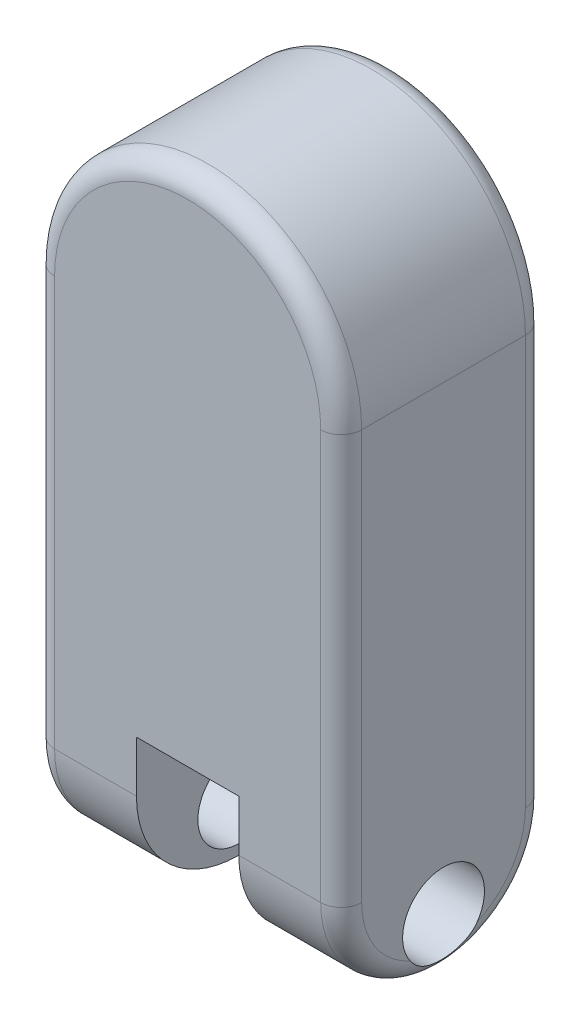
ISO-10303-21;
HEADER;
FILE_DESCRIPTION(('STEP AP214'),'2;1');
FILE_NAME('part.step','',(''),(''),'','','');
FILE_SCHEMA(('AUTOMOTIVE_DESIGN { 1 0 10303 214 1 1 1 1 }'));
ENDSEC;
DATA;
#1=APPLICATION_CONTEXT('core data for automotive mechanical design processes');
#2=APPLICATION_PROTOCOL_DEFINITION('international standard','automotive_design',2000,#1);
#3=PRODUCT_CONTEXT('',#1,'mechanical');
#4=PRODUCT('Part','Part','',(#3));
#5=PRODUCT_RELATED_PRODUCT_CATEGORY('part','',(#4));
#6=PRODUCT_DEFINITION_FORMATION('','',#4);
#7=PRODUCT_DEFINITION_CONTEXT('part definition',#1,'design');
#8=PRODUCT_DEFINITION('design','',#6,#7);
#9=PRODUCT_DEFINITION_SHAPE('','',#8);
#10=(LENGTH_UNIT() NAMED_UNIT(*) SI_UNIT(.MILLI.,.METRE.));
#11=(NAMED_UNIT(*) PLANE_ANGLE_UNIT() SI_UNIT($,.RADIAN.));
#12=(NAMED_UNIT(*) SI_UNIT($,.STERADIAN.) SOLID_ANGLE_UNIT());
#13=UNCERTAINTY_MEASURE_WITH_UNIT(LENGTH_MEASURE(1.E-05),#10,'distance_accuracy_value','');
#14=(GEOMETRIC_REPRESENTATION_CONTEXT(3) GLOBAL_UNCERTAINTY_ASSIGNED_CONTEXT((#13)) GLOBAL_UNIT_ASSIGNED_CONTEXT((#10,
#11,#12)) REPRESENTATION_CONTEXT('',''));
#15=CARTESIAN_POINT('',(0.,0.,0.));
#16=DIRECTION('',(0.,0.,1.));
#17=DIRECTION('',(1.,0.,0.));
#18=AXIS2_PLACEMENT_3D('',#15,#16,#17);
#19=CARTESIAN_POINT('',(-25.,-75.,-100.1));
#20=DIRECTION('',(0.,-1.,0.));
#21=DIRECTION('',(0.,0.,-1.));
#22=AXIS2_PLACEMENT_3D('',#19,#20,#21);
#23=PLANE('',#22);
#24=DIRECTION('',(1.,0.,0.));
#25=VECTOR('',#24,1.);
#26=CARTESIAN_POINT('',(-25.,-75.,-100.));
#27=LINE('',#26,#25);
#28=CARTESIAN_POINT('',(-25.,-75.,-100.));
#29=VERTEX_POINT('',#28);
#30=CARTESIAN_POINT('',(25.,-75.,-100.));
#31=VERTEX_POINT('',#30);
#32=EDGE_CURVE('E92',#29,#31,#27,.T.);
#33=ORIENTED_EDGE('',*,*,#32,.T.);
#34=CARTESIAN_POINT('',(23.5893264020334,-75.,-90.1));
#35=DIRECTION('',(0.,-1.,0.));
#36=DIRECTION('',(0.,0.,-1.));
#37=AXIS2_PLACEMENT_3D('',#34,#35,#36);
#38=CIRCLE('',#37,10.);
#39=CARTESIAN_POINT('',(23.5893264020334,-75.,-100.1));
#40=VERTEX_POINT('',#39);
#41=EDGE_CURVE('E12',#31,#40,#38,.F.);
#42=ORIENTED_EDGE('',*,*,#41,.T.);
#43=DIRECTION('',(1.,0.,0.));
#44=VECTOR('',#43,1.);
#45=CARTESIAN_POINT('',(-25.,-75.,-100.1));
#46=LINE('',#45,#44);
#47=CARTESIAN_POINT('',(-23.5893264020334,-75.,-100.1));
#48=VERTEX_POINT('',#47);
#49=EDGE_CURVE('E116',#48,#40,#46,.T.);
#50=ORIENTED_EDGE('',*,*,#49,.F.);
#51=CARTESIAN_POINT('',(-23.5893264020334,-75.,-90.1));
#52=DIRECTION('',(0.,-1.,0.));
#53=DIRECTION('',(0.,0.,-1.));
#54=AXIS2_PLACEMENT_3D('',#51,#52,#53);
#55=CIRCLE('',#54,10.);
#56=EDGE_CURVE('E55',#48,#29,#55,.F.);
#57=ORIENTED_EDGE('',*,*,#56,.T.);
#58=EDGE_LOOP('',(#33,#42,#50,#57));
#59=FACE_BOUND('',#58,.T.);
#60=ADVANCED_FACE('F46',(#59),#23,.F.);
#61=CARTESIAN_POINT('',(0.,0.,-100.1));
#62=DIRECTION('',(0.,0.,-1.));
#63=DIRECTION('',(-1.,0.,0.));
#64=AXIS2_PLACEMENT_3D('',#61,#62,#63);
#65=PLANE('',#64);
#66=ORIENTED_EDGE('',*,*,#49,.T.);
#67=DIRECTION('',(0.,1.,0.));
#68=VECTOR('',#67,1.);
#69=CARTESIAN_POINT('',(23.5893264020334,-105.,-100.1));
#70=LINE('',#69,#68);
#71=CARTESIAN_POINT('',(23.5893264020334,-103.589326402033,-100.1));
#72=VERTEX_POINT('',#71);
#73=EDGE_CURVE('E104',#40,#72,#70,.F.);
#74=ORIENTED_EDGE('',*,*,#73,.T.);
#75=DIRECTION('',(1.,0.,0.));
#76=VECTOR('',#75,1.);
#77=CARTESIAN_POINT('',(-25.,-103.589326402033,-100.1));
#78=LINE('',#77,#76);
#79=CARTESIAN_POINT('',(-23.5893264020334,-103.589326402033,-100.1));
#80=VERTEX_POINT('',#79);
#81=EDGE_CURVE('E70',#72,#80,#78,.F.);
#82=ORIENTED_EDGE('',*,*,#81,.T.);
#83=DIRECTION('',(0.,-1.,0.));
#84=VECTOR('',#83,1.);
#85=CARTESIAN_POINT('',(-23.5893264020334,-75.,-100.1));
#86=LINE('',#85,#84);
#87=EDGE_CURVE('E107',#80,#48,#86,.F.);
#88=ORIENTED_EDGE('',*,*,#87,.T.);
#89=EDGE_LOOP('',(#66,#74,#82,#88));
#90=FACE_BOUND('',#89,.T.);
#91=ADVANCED_FACE('F120',(#90),#65,.T.);
#92=CARTESIAN_POINT('',(0.,0.,-100.));
#93=DIRECTION('',(0.,0.,-1.));
#94=DIRECTION('',(-1.,0.,0.));
#95=AXIS2_PLACEMENT_3D('',#92,#93,#94);
#96=PLANE('',#95);
#97=ORIENTED_EDGE('',*,*,#32,.F.);
#98=DIRECTION('',(0.,1.,0.));
#99=VECTOR('',#98,1.);
#100=CARTESIAN_POINT('',(-25.,-105.,-100.));
#101=LINE('',#100,#99);
#102=CARTESIAN_POINT('',(-25.,-105.,-100.));
#103=VERTEX_POINT('',#102);
#104=EDGE_CURVE('E115',#103,#29,#101,.T.);
#105=ORIENTED_EDGE('',*,*,#104,.F.);
#106=DIRECTION('',(-1.,0.,0.));
#107=VECTOR('',#106,1.);
#108=CARTESIAN_POINT('',(25.,-105.,-100.));
#109=LINE('',#108,#107);
#110=CARTESIAN_POINT('',(25.,-105.,-100.));
#111=VERTEX_POINT('',#110);
#112=EDGE_CURVE('E95',#111,#103,#109,.T.);
#113=ORIENTED_EDGE('',*,*,#112,.F.);
#114=DIRECTION('',(0.,-1.,0.));
#115=VECTOR('',#114,1.);
#116=CARTESIAN_POINT('',(25.,-75.,-100.));
#117=LINE('',#116,#115);
#118=EDGE_CURVE('E89',#31,#111,#117,.T.);
#119=ORIENTED_EDGE('',*,*,#118,.F.);
#120=EDGE_LOOP('',(#97,#105,#113,#119));
#121=FACE_BOUND('',#120,.T.);
#122=ADVANCED_FACE('F91',(#121),#96,.F.);
#123=CARTESIAN_POINT('',(-23.5893264020334,-105.,-90.1));
#124=DIRECTION('',(0.,1.,0.));
#125=DIRECTION('',(0.,0.,1.));
#126=AXIS2_PLACEMENT_3D('',#123,#124,#125);
#127=CYLINDRICAL_SURFACE('',#126,10.);
#128=ORIENTED_EDGE('',*,*,#56,.F.);
#129=ORIENTED_EDGE('',*,*,#87,.F.);
#130=CARTESIAN_POINT('',(-23.5893264020334,-103.589326402033,-90.1));
#131=DIRECTION('',(-0.707106781186547,0.707106781186547,0.));
#132=DIRECTION('',(0.707106781186547,0.707106781186547,0.));
#133=AXIS2_PLACEMENT_3D('',#130,#131,#132);
#134=ELLIPSE('',#133,14.1421356237309,10.);
#135=EDGE_CURVE('E50',#103,#80,#134,.F.);
#136=ORIENTED_EDGE('',*,*,#135,.F.);
#137=ORIENTED_EDGE('',*,*,#104,.T.);
#138=EDGE_LOOP('',(#128,#129,#136,#137));
#139=FACE_BOUND('',#138,.T.);
#140=ADVANCED_FACE('F48',(#139),#127,.T.);
#141=CARTESIAN_POINT('',(25.,-103.589326402033,-90.1));
#142=DIRECTION('',(-1.,0.,0.));
#143=DIRECTION('',(0.,0.,1.));
#144=AXIS2_PLACEMENT_3D('',#141,#142,#143);
#145=CYLINDRICAL_SURFACE('',#144,10.);
#146=ORIENTED_EDGE('',*,*,#135,.T.);
#147=ORIENTED_EDGE('',*,*,#81,.F.);
#148=CARTESIAN_POINT('',(23.5893264020334,-103.589326402033,-90.1));
#149=DIRECTION('',(-0.707106781186547,-0.707106781186548,0.));
#150=DIRECTION('',(-0.707106781186548,0.707106781186547,0.));
#151=AXIS2_PLACEMENT_3D('',#148,#149,#150);
#152=ELLIPSE('',#151,14.142135623731,10.);
#153=EDGE_CURVE('E63',#111,#72,#152,.F.);
#154=ORIENTED_EDGE('',*,*,#153,.F.);
#155=ORIENTED_EDGE('',*,*,#112,.T.);
#156=EDGE_LOOP('',(#146,#147,#154,#155));
#157=FACE_BOUND('',#156,.T.);
#158=ADVANCED_FACE('F113',(#157),#145,.T.);
#159=CARTESIAN_POINT('',(23.5893264020334,-75.,-90.1));
#160=DIRECTION('',(0.,-1.,0.));
#161=DIRECTION('',(1.,0.,0.));
#162=AXIS2_PLACEMENT_3D('',#159,#160,#161);
#163=CYLINDRICAL_SURFACE('',#162,10.);
#164=ORIENTED_EDGE('',*,*,#41,.F.);
#165=ORIENTED_EDGE('',*,*,#118,.T.);
#166=ORIENTED_EDGE('',*,*,#153,.T.);
#167=ORIENTED_EDGE('',*,*,#73,.F.);
#168=EDGE_LOOP('',(#164,#165,#166,#167));
#169=FACE_BOUND('',#168,.T.);
#170=ADVANCED_FACE('F103',(#169),#163,.T.);
#171=CLOSED_SHELL('',(#60,#91,#122,#140,#158,#170));
#172=MANIFOLD_SOLID_BREP('B2',#171);
#173=CARTESIAN_POINT('',(0.,-75.,-50.));
#174=DIRECTION('',(1.,0.,0.));
#175=DIRECTION('',(0.,0.,-1.));
#176=AXIS2_PLACEMENT_3D('',#173,#174,#175);
#177=CYLINDRICAL_SURFACE('',#176,50.);
#178=DIRECTION('',(1.,0.,0.));
#179=VECTOR('',#178,1.);
#180=CARTESIAN_POINT('',(0.,-75.,0.));
#181=LINE('',#180,#179);
#182=CARTESIAN_POINT('',(-65.,-75.,0.));
#183=VERTEX_POINT('',#182);
#184=CARTESIAN_POINT('',(-25.,-75.,0.));
#185=VERTEX_POINT('',#184);
#186=EDGE_CURVE('E367',#183,#185,#181,.T.);
#187=ORIENTED_EDGE('',*,*,#186,.F.);
#188=CARTESIAN_POINT('',(-65.,-75.,-50.));
#189=DIRECTION('',(-1.,0.,0.));
#190=DIRECTION('',(0.,-1.,0.));
#191=AXIS2_PLACEMENT_3D('',#188,#189,#190);
#192=CIRCLE('',#191,50.);
#193=CARTESIAN_POINT('',(-65.,-125.,-50.));
#194=VERTEX_POINT('',#193);
#195=EDGE_CURVE('E191',#183,#194,#192,.F.);
#196=ORIENTED_EDGE('',*,*,#195,.T.);
#197=DIRECTION('',(1.,0.,0.));
#198=VECTOR('',#197,1.);
#199=CARTESIAN_POINT('',(-75.,-125.,-50.));
#200=LINE('',#199,#198);
#201=CARTESIAN_POINT('',(-25.,-125.,-50.));
#202=VERTEX_POINT('',#201);
#203=EDGE_CURVE('E334',#202,#194,#200,.F.);
#204=ORIENTED_EDGE('',*,*,#203,.F.);
#205=CARTESIAN_POINT('',(-25.,-75.,-50.));
#206=DIRECTION('',(-1.,0.,0.));
#207=DIRECTION('',(0.,0.,1.));
#208=AXIS2_PLACEMENT_3D('',#205,#206,#207);
#209=CIRCLE('',#208,50.);
#210=EDGE_CURVE('E349',#185,#202,#209,.F.);
#211=ORIENTED_EDGE('',*,*,#210,.F.);
#212=EDGE_LOOP('',(#187,#196,#204,#211));
#213=FACE_BOUND('',#212,.T.);
#214=ADVANCED_FACE('F169',(#213),#177,.T.);
#215=CARTESIAN_POINT('',(-75.,-75.,-50.));
#216=DIRECTION('',(-1.,0.,0.));
#217=DIRECTION('',(0.,0.,1.));
#218=AXIS2_PLACEMENT_3D('',#215,#216,#217);
#219=CYLINDRICAL_SURFACE('',#218,50.);
#220=ORIENTED_EDGE('',*,*,#203,.T.);
#221=CARTESIAN_POINT('',(-65.,-75.,-50.));
#222=DIRECTION('',(-1.,0.,0.));
#223=DIRECTION('',(0.,-1.,0.));
#224=AXIS2_PLACEMENT_3D('',#221,#222,#223);
#225=CIRCLE('',#224,50.);
#226=CARTESIAN_POINT('',(-65.,-75.,-100.));
#227=VERTEX_POINT('',#226);
#228=EDGE_CURVE('E177',#194,#227,#225,.F.);
#229=ORIENTED_EDGE('',*,*,#228,.T.);
#230=DIRECTION('',(1.,0.,0.));
#231=VECTOR('',#230,1.);
#232=CARTESIAN_POINT('',(-75.,-75.,-100.));
#233=LINE('',#232,#231);
#234=CARTESIAN_POINT('',(-25.,-75.,-100.));
#235=VERTEX_POINT('',#234);
#236=EDGE_CURVE('E363',#235,#227,#233,.F.);
#237=ORIENTED_EDGE('',*,*,#236,.F.);
#238=CARTESIAN_POINT('',(-25.,-75.,-50.));
#239=DIRECTION('',(-1.,0.,0.));
#240=DIRECTION('',(0.,0.,1.));
#241=AXIS2_PLACEMENT_3D('',#238,#239,#240);
#242=CIRCLE('',#241,50.);
#243=EDGE_CURVE('E355',#202,#235,#242,.F.);
#244=ORIENTED_EDGE('',*,*,#243,.F.);
#245=EDGE_LOOP('',(#220,#229,#237,#244));
#246=FACE_BOUND('',#245,.T.);
#247=ADVANCED_FACE('F466',(#246),#219,.T.);
#248=CARTESIAN_POINT('',(75.,125.,-100.));
#249=DIRECTION('',(1.,0.,0.));
#250=DIRECTION('',(0.,1.,0.));
#251=AXIS2_PLACEMENT_3D('',#248,#249,#250);
#252=PLANE('',#251);
#253=CARTESIAN_POINT('',(75.,-75.,-50.));
#254=DIRECTION('',(1.,0.,0.));
#255=DIRECTION('',(0.,1.,0.));
#256=AXIS2_PLACEMENT_3D('',#253,#254,#255);
#257=CIRCLE('',#256,40.);
#258=CARTESIAN_POINT('',(75.0000000000001,-111.5,-66.3630681719536));
#259=VERTEX_POINT('',#258);
#260=CARTESIAN_POINT('',(75.,-75.,-90.));
#261=VERTEX_POINT('',#260);
#262=EDGE_CURVE('E389',#259,#261,#257,.T.);
#263=ORIENTED_EDGE('',*,*,#262,.T.);
#264=DIRECTION('',(0.,1.,0.));
#265=VECTOR('',#264,1.);
#266=CARTESIAN_POINT('',(75.,125.,-90.));
#267=LINE('',#266,#265);
#268=CARTESIAN_POINT('',(75.,125.,-90.));
#269=VERTEX_POINT('',#268);
#270=EDGE_CURVE('E391',#261,#269,#267,.T.);
#271=ORIENTED_EDGE('',*,*,#270,.T.);
#272=DIRECTION('',(0.,0.,1.));
#273=VECTOR('',#272,1.);
#274=CARTESIAN_POINT('',(75.,125.,-100.));
#275=LINE('',#274,#273);
#276=CARTESIAN_POINT('',(75.,125.,-9.99999999999999));
#277=VERTEX_POINT('',#276);
#278=EDGE_CURVE('E345',#269,#277,#275,.T.);
#279=ORIENTED_EDGE('',*,*,#278,.T.);
#280=DIRECTION('',(0.,1.,0.));
#281=VECTOR('',#280,1.);
#282=CARTESIAN_POINT('',(75.,125.,-9.99999999999999));
#283=LINE('',#282,#281);
#284=CARTESIAN_POINT('',(75.,-75.,-10.));
#285=VERTEX_POINT('',#284);
#286=EDGE_CURVE('E385',#277,#285,#283,.F.);
#287=ORIENTED_EDGE('',*,*,#286,.T.);
#288=CARTESIAN_POINT('',(75.,-75.,-50.));
#289=DIRECTION('',(1.,0.,0.));
#290=DIRECTION('',(0.,1.,0.));
#291=AXIS2_PLACEMENT_3D('',#288,#289,#290);
#292=CIRCLE('',#291,40.);
#293=CARTESIAN_POINT('',(75.,-111.5,-33.6369318280464));
#294=VERTEX_POINT('',#293);
#295=EDGE_CURVE('E387',#285,#294,#292,.T.);
#296=ORIENTED_EDGE('',*,*,#295,.T.);
#297=CARTESIAN_POINT('',(75.,-100.,-50.));
#298=DIRECTION('',(-1.,0.,0.));
#299=DIRECTION('',(0.,-1.,0.));
#300=AXIS2_PLACEMENT_3D('',#297,#298,#299);
#301=CIRCLE('',#300,20.);
#302=EDGE_CURVE('E335',#294,#259,#301,.T.);
#303=ORIENTED_EDGE('',*,*,#302,.T.);
#304=EDGE_LOOP('',(#263,#271,#279,#287,#296,#303));
#305=FACE_BOUND('',#304,.T.);
#306=ADVANCED_FACE('F471',(#305),#252,.T.);
#307=CARTESIAN_POINT('',(-75.,125.,-100.));
#308=DIRECTION('',(-1.,0.,0.));
#309=DIRECTION('',(0.,-1.,0.));
#310=AXIS2_PLACEMENT_3D('',#307,#308,#309);
#311=PLANE('',#310);
#312=CARTESIAN_POINT('',(-75.,-75.,-50.));
#313=DIRECTION('',(-1.,0.,0.));
#314=DIRECTION('',(0.,-1.,0.));
#315=AXIS2_PLACEMENT_3D('',#312,#313,#314);
#316=CIRCLE('',#315,40.);
#317=CARTESIAN_POINT('',(-75.,-111.5,-33.6369318280464));
#318=VERTEX_POINT('',#317);
#319=CARTESIAN_POINT('',(-75.,-75.,-10.));
#320=VERTEX_POINT('',#319);
#321=EDGE_CURVE('E539',#318,#320,#316,.T.);
#322=ORIENTED_EDGE('',*,*,#321,.T.);
#323=DIRECTION('',(0.,-1.,0.));
#324=VECTOR('',#323,1.);
#325=CARTESIAN_POINT('',(-75.,125.,-9.99999999999999));
#326=LINE('',#325,#324);
#327=CARTESIAN_POINT('',(-75.,125.,-9.99999999999999));
#328=VERTEX_POINT('',#327);
#329=EDGE_CURVE('E437',#320,#328,#326,.F.);
#330=ORIENTED_EDGE('',*,*,#329,.T.);
#331=DIRECTION('',(0.,0.,1.));
#332=VECTOR('',#331,1.);
#333=CARTESIAN_POINT('',(-75.,125.,-100.));
#334=LINE('',#333,#332);
#335=CARTESIAN_POINT('',(-75.,125.,-90.));
#336=VERTEX_POINT('',#335);
#337=EDGE_CURVE('E346',#336,#328,#334,.T.);
#338=ORIENTED_EDGE('',*,*,#337,.F.);
#339=DIRECTION('',(0.,-1.,0.));
#340=VECTOR('',#339,1.);
#341=CARTESIAN_POINT('',(-75.,-75.,-90.));
#342=LINE('',#341,#340);
#343=CARTESIAN_POINT('',(-75.,-75.,-90.));
#344=VERTEX_POINT('',#343);
#345=EDGE_CURVE('E533',#336,#344,#342,.T.);
#346=ORIENTED_EDGE('',*,*,#345,.T.);
#347=CARTESIAN_POINT('',(-75.,-75.,-50.));
#348=DIRECTION('',(-1.,0.,0.));
#349=DIRECTION('',(0.,-1.,0.));
#350=AXIS2_PLACEMENT_3D('',#347,#348,#349);
#351=CIRCLE('',#350,40.);
#352=CARTESIAN_POINT('',(-75.,-111.5,-66.3630681719536));
#353=VERTEX_POINT('',#352);
#354=EDGE_CURVE('E538',#344,#353,#351,.T.);
#355=ORIENTED_EDGE('',*,*,#354,.T.);
#356=CARTESIAN_POINT('',(-75.,-100.,-50.));
#357=DIRECTION('',(-1.,0.,0.));
#358=DIRECTION('',(0.,-1.,0.));
#359=AXIS2_PLACEMENT_3D('',#356,#357,#358);
#360=CIRCLE('',#359,20.);
#361=EDGE_CURVE('E339',#318,#353,#360,.T.);
#362=ORIENTED_EDGE('',*,*,#361,.F.);
#363=EDGE_LOOP('',(#322,#330,#338,#346,#355,#362));
#364=FACE_BOUND('',#363,.T.);
#365=ADVANCED_FACE('F544',(#364),#311,.T.);
#366=CARTESIAN_POINT('',(0.,0.,-100.));
#367=DIRECTION('',(0.,0.,1.));
#368=DIRECTION('',(1.,0.,0.));
#369=AXIS2_PLACEMENT_3D('',#366,#367,#368);
#370=PLANE('',#369);
#371=CARTESIAN_POINT('',(0.,125.,-100.));
#372=DIRECTION('',(0.,0.,1.));
#373=DIRECTION('',(1.,0.,0.));
#374=AXIS2_PLACEMENT_3D('',#371,#372,#373);
#375=CIRCLE('',#374,65.);
#376=CARTESIAN_POINT('',(-65.,125.,-100.));
#377=VERTEX_POINT('',#376);
#378=CARTESIAN_POINT('',(65.,125.,-100.));
#379=VERTEX_POINT('',#378);
#380=EDGE_CURVE('E380',#377,#379,#375,.F.);
#381=ORIENTED_EDGE('',*,*,#380,.T.);
#382=DIRECTION('',(0.,1.,0.));
#383=VECTOR('',#382,1.);
#384=CARTESIAN_POINT('',(65.,-75.,-100.));
#385=LINE('',#384,#383);
#386=CARTESIAN_POINT('',(65.,-75.,-100.));
#387=VERTEX_POINT('',#386);
#388=EDGE_CURVE('E383',#379,#387,#385,.F.);
#389=ORIENTED_EDGE('',*,*,#388,.T.);
#390=CARTESIAN_POINT('',(25.,-75.,-100.));
#391=VERTEX_POINT('',#390);
#392=EDGE_CURVE('E368',#387,#391,#233,.F.);
#393=ORIENTED_EDGE('',*,*,#392,.T.);
#394=DIRECTION('',(-1.,0.,0.));
#395=VECTOR('',#394,1.);
#396=CARTESIAN_POINT('',(-25.,-75.,-100.));
#397=LINE('',#396,#395);
#398=EDGE_CURVE('E328',#391,#235,#397,.T.);
#399=ORIENTED_EDGE('',*,*,#398,.T.);
#400=ORIENTED_EDGE('',*,*,#236,.T.);
#401=DIRECTION('',(0.,-1.,0.));
#402=VECTOR('',#401,1.);
#403=CARTESIAN_POINT('',(-65.,125.,-100.));
#404=LINE('',#403,#402);
#405=EDGE_CURVE('E378',#227,#377,#404,.F.);
#406=ORIENTED_EDGE('',*,*,#405,.T.);
#407=EDGE_LOOP('',(#381,#389,#393,#399,#400,#406));
#408=FACE_BOUND('',#407,.T.);
#409=ADVANCED_FACE('F583',(#408),#370,.F.);
#410=CARTESIAN_POINT('',(0.,0.,0.));
#411=DIRECTION('',(0.,0.,1.));
#412=DIRECTION('',(1.,0.,0.));
#413=AXIS2_PLACEMENT_3D('',#410,#411,#412);
#414=PLANE('',#413);
#415=DIRECTION('',(0.,-1.,0.));
#416=VECTOR('',#415,1.);
#417=CARTESIAN_POINT('',(-25.,-75.,0.));
#418=LINE('',#417,#416);
#419=CARTESIAN_POINT('',(-25.,-50.,0.));
#420=VERTEX_POINT('',#419);
#421=EDGE_CURVE('E313',#420,#185,#418,.T.);
#422=ORIENTED_EDGE('',*,*,#421,.F.);
#423=DIRECTION('',(-1.,0.,0.));
#424=VECTOR('',#423,1.);
#425=CARTESIAN_POINT('',(-25.,-50.,0.));
#426=LINE('',#425,#424);
#427=CARTESIAN_POINT('',(25.,-50.,0.));
#428=VERTEX_POINT('',#427);
#429=EDGE_CURVE('E320',#428,#420,#426,.T.);
#430=ORIENTED_EDGE('',*,*,#429,.F.);
#431=DIRECTION('',(0.,1.,0.));
#432=VECTOR('',#431,1.);
#433=CARTESIAN_POINT('',(25.,-50.,0.));
#434=LINE('',#433,#432);
#435=CARTESIAN_POINT('',(25.,-75.,0.));
#436=VERTEX_POINT('',#435);
#437=EDGE_CURVE('E304',#436,#428,#434,.T.);
#438=ORIENTED_EDGE('',*,*,#437,.F.);
#439=CARTESIAN_POINT('',(65.,-75.,0.));
#440=VERTEX_POINT('',#439);
#441=EDGE_CURVE('E370',#436,#440,#181,.T.);
#442=ORIENTED_EDGE('',*,*,#441,.T.);
#443=DIRECTION('',(0.,1.,0.));
#444=VECTOR('',#443,1.);
#445=CARTESIAN_POINT('',(65.,0.,0.));
#446=LINE('',#445,#444);
#447=CARTESIAN_POINT('',(65.,125.,0.));
#448=VERTEX_POINT('',#447);
#449=EDGE_CURVE('E524',#440,#448,#446,.T.);
#450=ORIENTED_EDGE('',*,*,#449,.T.);
#451=CARTESIAN_POINT('',(0.,125.,0.));
#452=DIRECTION('',(0.,0.,1.));
#453=DIRECTION('',(1.,0.,0.));
#454=AXIS2_PLACEMENT_3D('',#451,#452,#453);
#455=CIRCLE('',#454,65.);
#456=CARTESIAN_POINT('',(-65.,125.,0.));
#457=VERTEX_POINT('',#456);
#458=EDGE_CURVE('E529',#448,#457,#455,.T.);
#459=ORIENTED_EDGE('',*,*,#458,.T.);
#460=DIRECTION('',(0.,-1.,0.));
#461=VECTOR('',#460,1.);
#462=CARTESIAN_POINT('',(-65.,0.,0.));
#463=LINE('',#462,#461);
#464=EDGE_CURVE('E498',#457,#183,#463,.T.);
#465=ORIENTED_EDGE('',*,*,#464,.T.);
#466=ORIENTED_EDGE('',*,*,#186,.T.);
#467=EDGE_LOOP('',(#422,#430,#438,#442,#450,#459,#465,#466));
#468=FACE_BOUND('',#467,.T.);
#469=ADVANCED_FACE('F593',(#468),#414,.T.);
#470=CARTESIAN_POINT('',(25.,-150.,-100.));
#471=DIRECTION('',(1.,0.,0.));
#472=DIRECTION('',(0.,0.,-1.));
#473=AXIS2_PLACEMENT_3D('',#470,#471,#472);
#474=PLANE('',#473);
#475=CARTESIAN_POINT('',(25.,-75.,-50.));
#476=DIRECTION('',(1.,0.,0.));
#477=DIRECTION('',(0.,0.,-1.));
#478=AXIS2_PLACEMENT_3D('',#475,#476,#477);
#479=CIRCLE('',#478,50.);
#480=CARTESIAN_POINT('',(25.,-125.,-50.));
#481=VERTEX_POINT('',#480);
#482=EDGE_CURVE('E358',#481,#436,#479,.F.);
#483=ORIENTED_EDGE('',*,*,#482,.T.);
#484=ORIENTED_EDGE('',*,*,#437,.T.);
#485=DIRECTION('',(0.,0.,1.));
#486=VECTOR('',#485,1.);
#487=CARTESIAN_POINT('',(25.,-50.,-99.));
#488=LINE('',#487,#486);
#489=CARTESIAN_POINT('',(25.,-50.,-99.));
#490=VERTEX_POINT('',#489);
#491=EDGE_CURVE('E296',#490,#428,#488,.T.);
#492=ORIENTED_EDGE('',*,*,#491,.F.);
#493=DIRECTION('',(0.,1.,0.));
#494=VECTOR('',#493,1.);
#495=CARTESIAN_POINT('',(25.,-50.,-99.));
#496=LINE('',#495,#494);
#497=CARTESIAN_POINT('',(25.,-74.4302970896538,-99.));
#498=VERTEX_POINT('',#497);
#499=EDGE_CURVE('E302',#498,#490,#496,.T.);
#500=ORIENTED_EDGE('',*,*,#499,.F.);
#501=CARTESIAN_POINT('',(25.,-161.602540378444,-50.));
#502=DIRECTION('',(1.,0.,0.));
#503=DIRECTION('',(0.,0.,-1.));
#504=AXIS2_PLACEMENT_3D('',#501,#502,#503);
#505=CIRCLE('',#504,100.);
#506=EDGE_CURVE('E329',#391,#498,#505,.T.);
#507=ORIENTED_EDGE('',*,*,#506,.F.);
#508=CARTESIAN_POINT('',(25.,-75.,-50.));
#509=DIRECTION('',(1.,0.,0.));
#510=DIRECTION('',(0.,0.,-1.));
#511=AXIS2_PLACEMENT_3D('',#508,#509,#510);
#512=CIRCLE('',#511,50.);
#513=EDGE_CURVE('E360',#391,#481,#512,.F.);
#514=ORIENTED_EDGE('',*,*,#513,.T.);
#515=EDGE_LOOP('',(#483,#484,#492,#500,#507,#514));
#516=FACE_BOUND('',#515,.T.);
#517=CARTESIAN_POINT('',(25.,-100.,-50.));
#518=DIRECTION('',(1.,0.,0.));
#519=DIRECTION('',(0.,0.,-1.));
#520=AXIS2_PLACEMENT_3D('',#517,#518,#519);
#521=CIRCLE('',#520,20.);
#522=CARTESIAN_POINT('',(25.,-100.,-70.));
#523=VERTEX_POINT('',#522);
#524=EDGE_CURVE('E342',#523,#523,#521,.T.);
#525=ORIENTED_EDGE('',*,*,#524,.T.);
#526=EDGE_LOOP('',(#525));
#527=FACE_BOUND('',#526,.T.);
#528=ADVANCED_FACE('F299',(#516,#527),#474,.F.);
#529=CARTESIAN_POINT('',(-25.,-150.,-100.));
#530=DIRECTION('',(-1.,0.,0.));
#531=DIRECTION('',(0.,0.,1.));
#532=AXIS2_PLACEMENT_3D('',#529,#530,#531);
#533=PLANE('',#532);
#534=ORIENTED_EDGE('',*,*,#421,.T.);
#535=ORIENTED_EDGE('',*,*,#210,.T.);
#536=ORIENTED_EDGE('',*,*,#243,.T.);
#537=CARTESIAN_POINT('',(-25.,-161.602540378444,-50.));
#538=DIRECTION('',(1.,0.,0.));
#539=DIRECTION('',(0.,0.,-1.));
#540=AXIS2_PLACEMENT_3D('',#537,#538,#539);
#541=CIRCLE('',#540,100.);
#542=CARTESIAN_POINT('',(-25.,-74.4302970896538,-99.));
#543=VERTEX_POINT('',#542);
#544=EDGE_CURVE('E325',#235,#543,#541,.T.);
#545=ORIENTED_EDGE('',*,*,#544,.T.);
#546=DIRECTION('',(0.,-1.,0.));
#547=VECTOR('',#546,1.);
#548=CARTESIAN_POINT('',(-25.,-75.,-99.));
#549=LINE('',#548,#547);
#550=CARTESIAN_POINT('',(-25.,-50.,-99.));
#551=VERTEX_POINT('',#550);
#552=EDGE_CURVE('E184',#551,#543,#549,.T.);
#553=ORIENTED_EDGE('',*,*,#552,.F.);
#554=DIRECTION('',(0.,0.,1.));
#555=VECTOR('',#554,1.);
#556=CARTESIAN_POINT('',(-25.,-50.,-99.));
#557=LINE('',#556,#555);
#558=EDGE_CURVE('E309',#551,#420,#557,.T.);
#559=ORIENTED_EDGE('',*,*,#558,.T.);
#560=EDGE_LOOP('',(#534,#535,#536,#545,#553,#559));
#561=FACE_BOUND('',#560,.T.);
#562=CARTESIAN_POINT('',(-25.,-100.,-50.));
#563=DIRECTION('',(-1.,0.,0.));
#564=DIRECTION('',(0.,0.,1.));
#565=AXIS2_PLACEMENT_3D('',#562,#563,#564);
#566=CIRCLE('',#565,20.);
#567=CARTESIAN_POINT('',(-25.,-100.,-30.));
#568=VERTEX_POINT('',#567);
#569=EDGE_CURVE('E338',#568,#568,#566,.T.);
#570=ORIENTED_EDGE('',*,*,#569,.T.);
#571=EDGE_LOOP('',(#570));
#572=FACE_BOUND('',#571,.T.);
#573=ADVANCED_FACE('F422',(#561,#572),#533,.F.);
#574=CARTESIAN_POINT('',(75.,-100.,-50.));
#575=DIRECTION('',(-1.,0.,0.));
#576=DIRECTION('',(0.,-1.,0.));
#577=AXIS2_PLACEMENT_3D('',#574,#575,#576);
#578=CYLINDRICAL_SURFACE('',#577,20.);
#579=CARTESIAN_POINT('',(-75.,-111.5,-66.3630681719536));
#580=CARTESIAN_POINT('',(-74.9999944988369,-111.717635786294,-66.2101150233158));
#581=CARTESIAN_POINT('',(-74.9972251505422,-111.932182024762,-66.0528421805292));
#582=CARTESIAN_POINT('',(-74.9867556613727,-112.35473388776,-65.7299474304971));
#583=CARTESIAN_POINT('',(-74.9790561221654,-112.562740307143,-65.5643265442968));
#584=CARTESIAN_POINT('',(-74.9494718778201,-113.176161814739,-65.0555886797702));
#585=CARTESIAN_POINT('',(-74.9210996400918,-113.571325329765,-64.7003530754296));
#586=CARTESIAN_POINT('',(-74.8515096756831,-114.330811895632,-63.9609577577296));
#587=CARTESIAN_POINT('',(-74.8103152955771,-114.695189480587,-63.576851568469));
#588=CARTESIAN_POINT('',(-74.7190573029856,-115.391950208584,-62.7815251896324));
#589=CARTESIAN_POINT('',(-74.6689923089183,-115.724328355308,-62.3703007827167));
#590=CARTESIAN_POINT('',(-74.5631593930954,-116.358618976357,-61.5187034560061));
#591=CARTESIAN_POINT('',(-74.5073357106278,-116.660163582177,-61.0780636594513));
#592=CARTESIAN_POINT('',(-74.3940622995594,-117.226993438192,-60.1742441935076));
#593=CARTESIAN_POINT('',(-74.3366125479803,-117.492278175682,-59.7110642055319));
#594=CARTESIAN_POINT('',(-74.2235017558159,-117.985054029716,-58.7648363026767));
#595=CARTESIAN_POINT('',(-74.167840615512,-118.212547256171,-58.2817894988468));
#596=CARTESIAN_POINT('',(-74.0614849028067,-118.628363325728,-57.2985605452277));
#597=CARTESIAN_POINT('',(-74.0107905215469,-118.816684661646,-56.7983777369727));
#598=CARTESIAN_POINT('',(-73.914628020795,-119.162335252227,-55.7553050669512));
#599=CARTESIAN_POINT('',(-73.8696146444547,-119.31732359583,-55.2115959974652));
#600=CARTESIAN_POINT('',(-73.7912772213222,-119.580856141992,-54.1121164115953));
#601=CARTESIAN_POINT('',(-73.7579530630838,-119.689400787352,-53.5563460102591));
#602=CARTESIAN_POINT('',(-73.7183397843355,-119.816752364834,-52.7160701639446));
#603=CARTESIAN_POINT('',(-73.7068534918599,-119.853323941299,-52.434388327726));
#604=CARTESIAN_POINT('',(-73.6875556329067,-119.914450380322,-51.869577925022));
#605=CARTESIAN_POINT('',(-73.6797440577708,-119.939005271195,-51.586449361947));
#606=CARTESIAN_POINT('',(-73.6679366207012,-119.976034163262,-51.0192418997108));
#607=CARTESIAN_POINT('',(-73.6639419207102,-119.988504485659,-50.7351627375597));
#608=CARTESIAN_POINT('',(-73.6598264732936,-120.001327339773,-50.1666967726029));
#609=CARTESIAN_POINT('',(-73.6597058137055,-120.001679596733,-49.882309962968));
#610=CARTESIAN_POINT('',(-73.6615493262836,-119.995960582491,-49.5980542531014));
#611=B_SPLINE_CURVE_WITH_KNOTS('',3,(#579,#580,#581,#582,#583,#584,#585,#586,#587,#588,#589,
#590,#591,#592,#593,#594,#595,#596,#597,#598,#599,#600,#601,#602,#603,#604,#605,#606,#607,#608,
#609,#610),.UNSPECIFIED.,.F.,.F.,(4,2,2,2,2,2,2,2,2,2,2,2,2,2,2,4),(0.,0.797874642750546,
1.59565193352407,3.18994126089919,4.78134451960051,6.37299585463968,7.98184001143661,
9.59070691451071,11.1994839638915,12.8083229014095,14.5077128583875,16.2070866127463,
17.0596892460926,17.91228987052,18.7651499631724,19.6180293930039),.UNSPECIFIED.);
#612=CARTESIAN_POINT('',(-73.6602540378444,-120.,-50.));
#613=VERTEX_POINT('',#612);
#614=EDGE_CURVE('E429',#353,#613,#611,.T.);
#615=ORIENTED_EDGE('',*,*,#614,.T.);
#616=CARTESIAN_POINT('',(-73.6602540378444,-120.,-50.));
#617=CARTESIAN_POINT('',(-73.660247528865,-120.000000557423,-49.7291162562174));
#618=CARTESIAN_POINT('',(-73.6620203059655,-119.994495715576,-49.4582663052626));
#619=CARTESIAN_POINT('',(-73.6690632302412,-119.972496289671,-48.9170644816353));
#620=CARTESIAN_POINT('',(-73.6743333002115,-119.956001948214,-48.6467125980998));
#621=CARTESIAN_POINT('',(-73.6952902819851,-119.8900894424,-47.8373209986367));
#622=CARTESIAN_POINT('',(-73.7161240917141,-119.824241746037,-47.2996541799824));
#623=CARTESIAN_POINT('',(-73.7701739357349,-119.649543192614,-46.2334838396406));
#624=CARTESIAN_POINT('',(-73.8033583037589,-119.540802269524,-45.7049604702912));
#625=CARTESIAN_POINT('',(-73.8801161670473,-119.281208901752,-44.6590938773701));
#626=CARTESIAN_POINT('',(-73.9236903013259,-119.130353866779,-44.1417513436021));
#627=CARTESIAN_POINT('',(-74.0189152913429,-118.786789461718,-43.1189296044383));
#628=CARTESIAN_POINT('',(-74.0706068716683,-118.593867036125,-42.6135258599768));
#629=CARTESIAN_POINT('',(-74.1788835403941,-118.16796707267,-41.6204488654864));
#630=CARTESIAN_POINT('',(-74.2354685830894,-117.934989908899,-41.1327754499163));
#631=CARTESIAN_POINT('',(-74.3502215235499,-117.430402873405,-40.1779497284365));
#632=CARTESIAN_POINT('',(-74.4083896442132,-117.158787538414,-39.7108003367798));
#633=CARTESIAN_POINT('',(-74.5227473765823,-116.578517537487,-38.7998012021265));
#634=CARTESIAN_POINT('',(-74.5789368427548,-116.269860154377,-38.3559531718098));
#635=CARTESIAN_POINT('',(-74.6878982994192,-115.602912464245,-37.4753289636808));
#636=CARTESIAN_POINT('',(-74.740412180585,-115.243038677624,-37.0397174887075));
#637=CARTESIAN_POINT('',(-74.8345685865417,-114.487138492257,-36.1999281519389));
#638=CARTESIAN_POINT('',(-74.8762127470129,-114.09111754507,-35.7957455671454));
#639=CARTESIAN_POINT('',(-74.9437724111679,-113.26432007541,-35.0206968408248));
#640=CARTESIAN_POINT('',(-74.969646571122,-112.833455521703,-34.6499204268788));
#641=CARTESIAN_POINT('',(-74.992406932906,-112.164262783443,-34.1219764911395));
#642=CARTESIAN_POINT('',(-74.997317042392,-111.937265917523,-33.9506217314705));
#643=CARTESIAN_POINT('',(-75.001019493978,-111.47611190923,-33.6177002554482));
#644=CARTESIAN_POINT('',(-74.9998109947271,-111.241953786537,-33.4561348882949));
#645=CARTESIAN_POINT('',(-74.9951651075579,-111.004453188326,-33.299640422256));
#646=B_SPLINE_CURVE_WITH_KNOTS('',3,(#616,#617,#618,#619,#620,#621,#622,#623,#624,#625,#626,
#627,#628,#629,#630,#631,#632,#633,#634,#635,#636,#637,#638,#639,#640,#641,#642,#643,#644,#645),
.UNSPECIFIED.,.F.,.F.,(4,2,2,2,2,2,2,2,2,2,2,2,2,2,4),(0.,0.812522437824889,1.62502693931455,
3.24916534614429,4.86916790626039,6.4892701290476,8.11777645816379,9.74626757863837,
11.3749891898565,13.0038303470725,14.704137296452,16.404188235224,18.1086771866605,
18.9617565600298,19.8149532408673),.UNSPECIFIED.);
#647=EDGE_CURVE('E436',#613,#318,#646,.T.);
#648=ORIENTED_EDGE('',*,*,#647,.T.);
#649=ORIENTED_EDGE('',*,*,#361,.T.);
#650=EDGE_LOOP('',(#615,#648,#649));
#651=FACE_BOUND('',#650,.T.);
#652=ORIENTED_EDGE('',*,*,#569,.F.);
#653=EDGE_LOOP('',(#652));
#654=FACE_BOUND('',#653,.T.);
#655=ADVANCED_FACE('F418',(#651,#654),#578,.F.);
#656=CARTESIAN_POINT('',(75.,-111.5,-33.6369318280464));
#657=CARTESIAN_POINT('',(74.9999944988369,-111.717635786294,-33.7898849766843));
#658=CARTESIAN_POINT('',(74.9972251505423,-111.932182024762,-33.9471578194709));
#659=CARTESIAN_POINT('',(74.9867556613727,-112.35473388776,-34.2700525695029));
#660=CARTESIAN_POINT('',(74.9790561221654,-112.562740307143,-34.4356734557032));
#661=CARTESIAN_POINT('',(74.9494718778202,-113.176161814739,-34.9444113202299));
#662=CARTESIAN_POINT('',(74.9210996400918,-113.571325329765,-35.2996469245705));
#663=CARTESIAN_POINT('',(74.8515096756831,-114.330811895632,-36.0390422422705));
#664=CARTESIAN_POINT('',(74.8103152955772,-114.695189480587,-36.4231484315311));
#665=CARTESIAN_POINT('',(74.7190573029856,-115.391950208584,-37.2184748103677));
#666=CARTESIAN_POINT('',(74.6689923089183,-115.724328355308,-37.6296992172834));
#667=CARTESIAN_POINT('',(74.5631593930954,-116.358618976357,-38.481296543994));
#668=CARTESIAN_POINT('',(74.5073357106278,-116.660163582177,-38.9219363405487));
#669=CARTESIAN_POINT('',(74.3940622995594,-117.226993438192,-39.8257558064924));
#670=CARTESIAN_POINT('',(74.3366125479804,-117.492278175682,-40.2889357944682));
#671=CARTESIAN_POINT('',(74.223501755816,-117.985054029716,-41.2351636973234));
#672=CARTESIAN_POINT('',(74.1678406155121,-118.212547256171,-41.7182105011532));
#673=CARTESIAN_POINT('',(74.0614849028068,-118.628363325728,-42.7014394547724));
#674=CARTESIAN_POINT('',(74.0107905215469,-118.816684661646,-43.2016222630274));
#675=CARTESIAN_POINT('',(73.914628020795,-119.162335252227,-44.2446949330489));
#676=CARTESIAN_POINT('',(73.8696146444547,-119.31732359583,-44.7884040025349));
#677=CARTESIAN_POINT('',(73.7912772213223,-119.580856141992,-45.8878835884048));
#678=CARTESIAN_POINT('',(73.7579530630838,-119.689400787352,-46.443653989741));
#679=CARTESIAN_POINT('',(73.7183397843356,-119.816752364834,-47.2839298360555));
#680=CARTESIAN_POINT('',(73.7068534918599,-119.853323941299,-47.5656116722741));
#681=CARTESIAN_POINT('',(73.6875556329068,-119.914450380322,-48.1304220749781));
#682=CARTESIAN_POINT('',(73.6797440577708,-119.939005271195,-48.4135506380531));
#683=CARTESIAN_POINT('',(73.6679366207012,-119.976034163262,-48.9807581002893));
#684=CARTESIAN_POINT('',(73.6639419207102,-119.988504485659,-49.2648372624404));
#685=CARTESIAN_POINT('',(73.6598264732937,-120.001327339773,-49.8333032273972));
#686=CARTESIAN_POINT('',(73.6597058137055,-120.001679596733,-50.117690037032));
#687=CARTESIAN_POINT('',(73.6615493262836,-119.995960582491,-50.4019457468986));
#688=B_SPLINE_CURVE_WITH_KNOTS('',3,(#656,#657,#658,#659,#660,#661,#662,#663,#664,#665,#666,
#667,#668,#669,#670,#671,#672,#673,#674,#675,#676,#677,#678,#679,#680,#681,#682,#683,#684,#685,
#686,#687),.UNSPECIFIED.,.F.,.F.,(4,2,2,2,2,2,2,2,2,2,2,2,2,2,2,4),(0.,0.797874642750549,
1.59565193352407,3.1899412608992,4.78134451960055,6.37299585463971,7.98184001143661,
9.59070691451072,11.1994839638915,12.8083229014095,14.5077128583875,16.2070866127463,
17.0596892460926,17.91228987052,18.7651499631725,19.6180293930039),.UNSPECIFIED.);
#689=CARTESIAN_POINT('',(73.6602540378444,-120.,-50.));
#690=VERTEX_POINT('',#689);
#691=EDGE_CURVE('E393',#294,#690,#688,.T.);
#692=ORIENTED_EDGE('',*,*,#691,.T.);
#693=CARTESIAN_POINT('',(73.6602540378444,-120.,-50.));
#694=CARTESIAN_POINT('',(73.660247528865,-120.000000557423,-50.2708837437826));
#695=CARTESIAN_POINT('',(73.6620203059656,-119.994495715576,-50.5417336947374));
#696=CARTESIAN_POINT('',(73.6690632302413,-119.972496289671,-51.0829355183647));
#697=CARTESIAN_POINT('',(73.6743333002116,-119.956001948214,-51.3532874019002));
#698=CARTESIAN_POINT('',(73.6952902819852,-119.8900894424,-52.1626790013633));
#699=CARTESIAN_POINT('',(73.7161240917141,-119.824241746037,-52.7003458200177));
#700=CARTESIAN_POINT('',(73.7701739357349,-119.649543192614,-53.7665161603594));
#701=CARTESIAN_POINT('',(73.8033583037589,-119.540802269524,-54.2950395297088));
#702=CARTESIAN_POINT('',(73.8801161670473,-119.281208901752,-55.3409061226299));
#703=CARTESIAN_POINT('',(73.9236903013259,-119.130353866779,-55.8582486563979));
#704=CARTESIAN_POINT('',(74.0189152913429,-118.786789461718,-56.8810703955617));
#705=CARTESIAN_POINT('',(74.0706068716683,-118.593867036125,-57.3864741400232));
#706=CARTESIAN_POINT('',(74.1788835403941,-118.16796707267,-58.3795511345136));
#707=CARTESIAN_POINT('',(74.2354685830894,-117.934989908899,-58.8672245500837));
#708=CARTESIAN_POINT('',(74.3502215235499,-117.430402873405,-59.8220502715635));
#709=CARTESIAN_POINT('',(74.4083896442133,-117.158787538414,-60.2891996632202));
#710=CARTESIAN_POINT('',(74.5227473765823,-116.578517537487,-61.2001987978735));
#711=CARTESIAN_POINT('',(74.5789368427548,-116.269860154377,-61.6440468281903));
#712=CARTESIAN_POINT('',(74.6878982994192,-115.602912464245,-62.5246710363192));
#713=CARTESIAN_POINT('',(74.740412180585,-115.243038677624,-62.9602825112926));
#714=CARTESIAN_POINT('',(74.8345685865418,-114.487138492257,-63.8000718480611));
#715=CARTESIAN_POINT('',(74.8762127470129,-114.09111754507,-64.2042544328546));
#716=CARTESIAN_POINT('',(74.943772411168,-113.26432007541,-64.9793031591752));
#717=CARTESIAN_POINT('',(74.969646571122,-112.833455521703,-65.3500795731212));
#718=CARTESIAN_POINT('',(74.992406932906,-112.164262783443,-65.8780235088606));
#719=CARTESIAN_POINT('',(74.997317042392,-111.937265917523,-66.0493782685295));
#720=CARTESIAN_POINT('',(75.001019493978,-111.47611190923,-66.3822997445518));
#721=CARTESIAN_POINT('',(74.9998109947272,-111.241953786537,-66.5438651117052));
#722=CARTESIAN_POINT('',(74.9951651075579,-111.004453188326,-66.700359577744));
#723=B_SPLINE_CURVE_WITH_KNOTS('',3,(#693,#694,#695,#696,#697,#698,#699,#700,#701,#702,#703,
#704,#705,#706,#707,#708,#709,#710,#711,#712,#713,#714,#715,#716,#717,#718,#719,#720,#721,#722),
.UNSPECIFIED.,.F.,.F.,(4,2,2,2,2,2,2,2,2,2,2,2,2,2,4),(0.,0.81252243782489,1.62502693931455,
3.24916534614429,4.86916790626039,6.48927012904759,8.11777645816379,9.74626757863838,
11.3749891898565,13.0038303470725,14.7041372964521,16.404188235224,18.1086771866605,
18.9617565600298,19.8149532408674),.UNSPECIFIED.);
#724=EDGE_CURVE('E401',#690,#259,#723,.T.);
#725=ORIENTED_EDGE('',*,*,#724,.T.);
#726=ORIENTED_EDGE('',*,*,#302,.F.);
#727=EDGE_LOOP('',(#692,#725,#726));
#728=FACE_BOUND('',#727,.T.);
#729=ORIENTED_EDGE('',*,*,#524,.F.);
#730=EDGE_LOOP('',(#729));
#731=FACE_BOUND('',#730,.T.);
#732=ADVANCED_FACE('F412',(#728,#731),#578,.F.);
#733=DIRECTION('',(1.,0.,0.));
#734=VECTOR('',#733,1.);
#735=CARTESIAN_POINT('',(50.,-125.,-50.));
#736=LINE('',#735,#734);
#737=CARTESIAN_POINT('',(65.,-125.,-50.));
#738=VERTEX_POINT('',#737);
#739=EDGE_CURVE('E364',#738,#481,#736,.F.);
#740=ORIENTED_EDGE('',*,*,#739,.F.);
#741=CARTESIAN_POINT('',(65.,-75.,-50.));
#742=DIRECTION('',(1.,0.,0.));
#743=DIRECTION('',(0.,1.,0.));
#744=AXIS2_PLACEMENT_3D('',#741,#742,#743);
#745=CIRCLE('',#744,50.);
#746=EDGE_CURVE('E486',#738,#440,#745,.F.);
#747=ORIENTED_EDGE('',*,*,#746,.T.);
#748=ORIENTED_EDGE('',*,*,#441,.F.);
#749=ORIENTED_EDGE('',*,*,#482,.F.);
#750=EDGE_LOOP('',(#740,#747,#748,#749));
#751=FACE_BOUND('',#750,.T.);
#752=ADVANCED_FACE('F417',(#751),#177,.T.);
#753=ORIENTED_EDGE('',*,*,#392,.F.);
#754=CARTESIAN_POINT('',(65.,-75.,-50.));
#755=DIRECTION('',(1.,0.,0.));
#756=DIRECTION('',(0.,1.,0.));
#757=AXIS2_PLACEMENT_3D('',#754,#755,#756);
#758=CIRCLE('',#757,50.);
#759=EDGE_CURVE('E499',#387,#738,#758,.F.);
#760=ORIENTED_EDGE('',*,*,#759,.T.);
#761=ORIENTED_EDGE('',*,*,#739,.T.);
#762=ORIENTED_EDGE('',*,*,#513,.F.);
#763=EDGE_LOOP('',(#753,#760,#761,#762));
#764=FACE_BOUND('',#763,.T.);
#765=ADVANCED_FACE('F474',(#764),#219,.T.);
#766=CARTESIAN_POINT('',(-25.,-161.602540378444,-50.));
#767=DIRECTION('',(1.,0.,0.));
#768=DIRECTION('',(0.,0.,-1.));
#769=AXIS2_PLACEMENT_3D('',#766,#767,#768);
#770=CYLINDRICAL_SURFACE('',#769,100.);
#771=ORIENTED_EDGE('',*,*,#506,.T.);
#772=DIRECTION('',(1.,0.,0.));
#773=VECTOR('',#772,1.);
#774=CARTESIAN_POINT('',(-25.,-74.4302970896538,-99.));
#775=LINE('',#774,#773);
#776=EDGE_CURVE('E44',#498,#543,#775,.F.);
#777=ORIENTED_EDGE('',*,*,#776,.T.);
#778=ORIENTED_EDGE('',*,*,#544,.F.);
#779=ORIENTED_EDGE('',*,*,#398,.F.);
#780=EDGE_LOOP('',(#771,#777,#778,#779));
#781=FACE_BOUND('',#780,.T.);
#782=ADVANCED_FACE('F420',(#781),#770,.F.);
#783=CARTESIAN_POINT('',(0.,125.,-100.));
#784=DIRECTION('',(0.,0.,1.));
#785=DIRECTION('',(1.,0.,0.));
#786=AXIS2_PLACEMENT_3D('',#783,#784,#785);
#787=CYLINDRICAL_SURFACE('',#786,75.);
#788=ORIENTED_EDGE('',*,*,#278,.F.);
#789=CARTESIAN_POINT('',(0.,125.,-90.));
#790=DIRECTION('',(0.,0.,1.));
#791=DIRECTION('',(1.,0.,0.));
#792=AXIS2_PLACEMENT_3D('',#789,#790,#791);
#793=CIRCLE('',#792,75.);
#794=EDGE_CURVE('E375',#269,#336,#793,.T.);
#795=ORIENTED_EDGE('',*,*,#794,.T.);
#796=ORIENTED_EDGE('',*,*,#337,.T.);
#797=CARTESIAN_POINT('',(0.,125.,-9.99999999999999));
#798=DIRECTION('',(0.,0.,1.));
#799=DIRECTION('',(1.,0.,0.));
#800=AXIS2_PLACEMENT_3D('',#797,#798,#799);
#801=CIRCLE('',#800,75.);
#802=EDGE_CURVE('E366',#328,#277,#801,.F.);
#803=ORIENTED_EDGE('',*,*,#802,.T.);
#804=EDGE_LOOP('',(#788,#795,#796,#803));
#805=FACE_BOUND('',#804,.T.);
#806=ADVANCED_FACE('F549',(#805),#787,.T.);
#807=CARTESIAN_POINT('',(0.,125.,-9.99999999999999));
#808=DIRECTION('',(0.,0.,1.));
#809=DIRECTION('',(1.,0.,0.));
#810=AXIS2_PLACEMENT_3D('',#807,#808,#809);
#811=TOROIDAL_SURFACE('',#810,65.,10.);
#812=CARTESIAN_POINT('',(-65.,125.,-10.));
#813=DIRECTION('',(0.,-1.,0.));
#814=DIRECTION('',(0.,0.,-1.));
#815=AXIS2_PLACEMENT_3D('',#812,#813,#814);
#816=CIRCLE('',#815,10.);
#817=EDGE_CURVE('E516',#457,#328,#816,.T.);
#818=ORIENTED_EDGE('',*,*,#817,.F.);
#819=ORIENTED_EDGE('',*,*,#458,.F.);
#820=CARTESIAN_POINT('',(65.,125.,-9.99999999999999));
#821=DIRECTION('',(0.,-1.,0.));
#822=DIRECTION('',(0.,0.,-1.));
#823=AXIS2_PLACEMENT_3D('',#820,#821,#822);
#824=CIRCLE('',#823,10.);
#825=EDGE_CURVE('E331',#277,#448,#824,.T.);
#826=ORIENTED_EDGE('',*,*,#825,.F.);
#827=ORIENTED_EDGE('',*,*,#802,.F.);
#828=EDGE_LOOP('',(#818,#819,#826,#827));
#829=FACE_BOUND('',#828,.T.);
#830=ADVANCED_FACE('F171',(#829),#811,.T.);
#831=CARTESIAN_POINT('',(65.,0.,-10.));
#832=DIRECTION('',(0.,1.,0.));
#833=DIRECTION('',(-1.,0.,0.));
#834=AXIS2_PLACEMENT_3D('',#831,#832,#833);
#835=CYLINDRICAL_SURFACE('',#834,10.);
#836=ORIENTED_EDGE('',*,*,#825,.T.);
#837=ORIENTED_EDGE('',*,*,#449,.F.);
#838=CARTESIAN_POINT('',(65.,-75.,-10.));
#839=DIRECTION('',(0.,-1.,0.));
#840=DIRECTION('',(0.,0.,-1.));
#841=AXIS2_PLACEMENT_3D('',#838,#839,#840);
#842=CIRCLE('',#841,10.);
#843=EDGE_CURVE('E497',#285,#440,#842,.T.);
#844=ORIENTED_EDGE('',*,*,#843,.F.);
#845=ORIENTED_EDGE('',*,*,#286,.F.);
#846=EDGE_LOOP('',(#836,#837,#844,#845));
#847=FACE_BOUND('',#846,.T.);
#848=ADVANCED_FACE('F523',(#847),#835,.T.);
#849=CARTESIAN_POINT('',(-65.,0.,-10.));
#850=DIRECTION('',(0.,-1.,0.));
#851=DIRECTION('',(1.,0.,0.));
#852=AXIS2_PLACEMENT_3D('',#849,#850,#851);
#853=CYLINDRICAL_SURFACE('',#852,10.);
#854=ORIENTED_EDGE('',*,*,#817,.T.);
#855=ORIENTED_EDGE('',*,*,#329,.F.);
#856=CARTESIAN_POINT('',(-65.,-75.,-10.));
#857=DIRECTION('',(0.,-1.,0.));
#858=DIRECTION('',(0.,0.,-1.));
#859=AXIS2_PLACEMENT_3D('',#856,#857,#858);
#860=CIRCLE('',#859,10.);
#861=EDGE_CURVE('E505',#183,#320,#860,.T.);
#862=ORIENTED_EDGE('',*,*,#861,.F.);
#863=ORIENTED_EDGE('',*,*,#464,.F.);
#864=EDGE_LOOP('',(#854,#855,#862,#863));
#865=FACE_BOUND('',#864,.T.);
#866=ADVANCED_FACE('F462',(#865),#853,.T.);
#867=CARTESIAN_POINT('',(65.,-75.,-50.));
#868=DIRECTION('',(1.,0.,0.));
#869=DIRECTION('',(0.,1.,0.));
#870=AXIS2_PLACEMENT_3D('',#867,#868,#869);
#871=TOROIDAL_SURFACE('',#870,40.,10.);
#872=ORIENTED_EDGE('',*,*,#843,.T.);
#873=ORIENTED_EDGE('',*,*,#746,.F.);
#874=CARTESIAN_POINT('',(65.,-115.,-50.));
#875=DIRECTION('',(0.,0.,-1.));
#876=DIRECTION('',(-1.,0.,0.));
#877=AXIS2_PLACEMENT_3D('',#874,#875,#876);
#878=CIRCLE('',#877,10.);
#879=EDGE_CURVE('E493',#690,#738,#878,.T.);
#880=ORIENTED_EDGE('',*,*,#879,.F.);
#881=ORIENTED_EDGE('',*,*,#691,.F.);
#882=ORIENTED_EDGE('',*,*,#295,.F.);
#883=EDGE_LOOP('',(#872,#873,#880,#881,#882));
#884=FACE_BOUND('',#883,.T.);
#885=ADVANCED_FACE('F408',(#884),#871,.T.);
#886=CARTESIAN_POINT('',(-65.,-75.,-50.));
#887=DIRECTION('',(-1.,0.,0.));
#888=DIRECTION('',(0.,-1.,0.));
#889=AXIS2_PLACEMENT_3D('',#886,#887,#888);
#890=TOROIDAL_SURFACE('',#889,40.,10.);
#891=ORIENTED_EDGE('',*,*,#321,.F.);
#892=ORIENTED_EDGE('',*,*,#647,.F.);
#893=CARTESIAN_POINT('',(-65.,-115.,-50.));
#894=DIRECTION('',(0.,0.,-1.));
#895=DIRECTION('',(-1.,0.,0.));
#896=AXIS2_PLACEMENT_3D('',#893,#894,#895);
#897=CIRCLE('',#896,10.);
#898=EDGE_CURVE('E506',#194,#613,#897,.T.);
#899=ORIENTED_EDGE('',*,*,#898,.F.);
#900=ORIENTED_EDGE('',*,*,#195,.F.);
#901=ORIENTED_EDGE('',*,*,#861,.T.);
#902=EDGE_LOOP('',(#891,#892,#899,#900,#901));
#903=FACE_BOUND('',#902,.T.);
#904=ADVANCED_FACE('F454',(#903),#890,.T.);
#905=CARTESIAN_POINT('',(65.,-75.,-50.));
#906=DIRECTION('',(1.,0.,0.));
#907=DIRECTION('',(0.,1.,0.));
#908=AXIS2_PLACEMENT_3D('',#905,#906,#907);
#909=TOROIDAL_SURFACE('',#908,40.,10.);
#910=ORIENTED_EDGE('',*,*,#879,.T.);
#911=ORIENTED_EDGE('',*,*,#759,.F.);
#912=CARTESIAN_POINT('',(65.,-75.,-90.));
#913=DIRECTION('',(0.,1.,0.));
#914=DIRECTION('',(0.,0.,1.));
#915=AXIS2_PLACEMENT_3D('',#912,#913,#914);
#916=CIRCLE('',#915,10.);
#917=EDGE_CURVE('E511',#261,#387,#916,.T.);
#918=ORIENTED_EDGE('',*,*,#917,.F.);
#919=ORIENTED_EDGE('',*,*,#262,.F.);
#920=ORIENTED_EDGE('',*,*,#724,.F.);
#921=EDGE_LOOP('',(#910,#911,#918,#919,#920));
#922=FACE_BOUND('',#921,.T.);
#923=ADVANCED_FACE('F449',(#922),#909,.T.);
#924=CARTESIAN_POINT('',(-65.,-75.,-50.));
#925=DIRECTION('',(-1.,0.,0.));
#926=DIRECTION('',(0.,-1.,0.));
#927=AXIS2_PLACEMENT_3D('',#924,#925,#926);
#928=TOROIDAL_SURFACE('',#927,40.,10.);
#929=ORIENTED_EDGE('',*,*,#614,.F.);
#930=ORIENTED_EDGE('',*,*,#354,.F.);
#931=CARTESIAN_POINT('',(-65.,-75.,-90.));
#932=DIRECTION('',(0.,1.,0.));
#933=DIRECTION('',(0.,0.,1.));
#934=AXIS2_PLACEMENT_3D('',#931,#932,#933);
#935=CIRCLE('',#934,10.);
#936=EDGE_CURVE('E565',#227,#344,#935,.T.);
#937=ORIENTED_EDGE('',*,*,#936,.F.);
#938=ORIENTED_EDGE('',*,*,#228,.F.);
#939=ORIENTED_EDGE('',*,*,#898,.T.);
#940=EDGE_LOOP('',(#929,#930,#937,#938,#939));
#941=FACE_BOUND('',#940,.T.);
#942=ADVANCED_FACE('F444',(#941),#928,.T.);
#943=CARTESIAN_POINT('',(65.,125.,-90.));
#944=DIRECTION('',(0.,-1.,0.));
#945=DIRECTION('',(1.,0.,0.));
#946=AXIS2_PLACEMENT_3D('',#943,#944,#945);
#947=CYLINDRICAL_SURFACE('',#946,10.);
#948=ORIENTED_EDGE('',*,*,#917,.T.);
#949=ORIENTED_EDGE('',*,*,#388,.F.);
#950=CARTESIAN_POINT('',(65.,125.,-90.));
#951=DIRECTION('',(0.,1.,0.));
#952=DIRECTION('',(0.,0.,1.));
#953=AXIS2_PLACEMENT_3D('',#950,#951,#952);
#954=CIRCLE('',#953,10.);
#955=EDGE_CURVE('E555',#269,#379,#954,.T.);
#956=ORIENTED_EDGE('',*,*,#955,.F.);
#957=ORIENTED_EDGE('',*,*,#270,.F.);
#958=EDGE_LOOP('',(#948,#949,#956,#957));
#959=FACE_BOUND('',#958,.T.);
#960=ADVANCED_FACE('F448',(#959),#947,.T.);
#961=CARTESIAN_POINT('',(-65.,125.,-90.));
#962=DIRECTION('',(0.,1.,0.));
#963=DIRECTION('',(-1.,0.,0.));
#964=AXIS2_PLACEMENT_3D('',#961,#962,#963);
#965=CYLINDRICAL_SURFACE('',#964,10.);
#966=ORIENTED_EDGE('',*,*,#936,.T.);
#967=ORIENTED_EDGE('',*,*,#345,.F.);
#968=CARTESIAN_POINT('',(-65.,125.,-90.));
#969=DIRECTION('',(0.,1.,0.));
#970=DIRECTION('',(0.,0.,1.));
#971=AXIS2_PLACEMENT_3D('',#968,#969,#970);
#972=CIRCLE('',#971,10.);
#973=EDGE_CURVE('E323',#377,#336,#972,.T.);
#974=ORIENTED_EDGE('',*,*,#973,.F.);
#975=ORIENTED_EDGE('',*,*,#405,.F.);
#976=EDGE_LOOP('',(#966,#967,#974,#975));
#977=FACE_BOUND('',#976,.T.);
#978=ADVANCED_FACE('F563',(#977),#965,.T.);
#979=CARTESIAN_POINT('',(0.,125.,-90.));
#980=DIRECTION('',(0.,0.,1.));
#981=DIRECTION('',(1.,0.,0.));
#982=AXIS2_PLACEMENT_3D('',#979,#980,#981);
#983=TOROIDAL_SURFACE('',#982,65.,10.);
#984=ORIENTED_EDGE('',*,*,#955,.T.);
#985=ORIENTED_EDGE('',*,*,#380,.F.);
#986=ORIENTED_EDGE('',*,*,#973,.T.);
#987=ORIENTED_EDGE('',*,*,#794,.F.);
#988=EDGE_LOOP('',(#984,#985,#986,#987));
#989=FACE_BOUND('',#988,.T.);
#990=ADVANCED_FACE('F553',(#989),#983,.T.);
#991=CARTESIAN_POINT('',(-25.,-50.,-99.));
#992=DIRECTION('',(0.,1.,0.));
#993=DIRECTION('',(-1.,0.,0.));
#994=AXIS2_PLACEMENT_3D('',#991,#992,#993);
#995=PLANE('',#994);
#996=ORIENTED_EDGE('',*,*,#491,.T.);
#997=ORIENTED_EDGE('',*,*,#429,.T.);
#998=ORIENTED_EDGE('',*,*,#558,.F.);
#999=DIRECTION('',(-1.,0.,0.));
#1000=VECTOR('',#999,1.);
#1001=CARTESIAN_POINT('',(-25.,-50.,-99.));
#1002=LINE('',#1001,#1000);
#1003=EDGE_CURVE('E312',#490,#551,#1002,.T.);
#1004=ORIENTED_EDGE('',*,*,#1003,.F.);
#1005=EDGE_LOOP('',(#996,#997,#998,#1004));
#1006=FACE_BOUND('',#1005,.T.);
#1007=ADVANCED_FACE('F315',(#1006),#995,.F.);
#1008=CARTESIAN_POINT('',(0.,0.,-99.));
#1009=DIRECTION('',(0.,0.,-1.));
#1010=DIRECTION('',(-1.,0.,0.));
#1011=AXIS2_PLACEMENT_3D('',#1008,#1009,#1010);
#1012=PLANE('',#1011);
#1013=ORIENTED_EDGE('',*,*,#499,.T.);
#1014=ORIENTED_EDGE('',*,*,#1003,.T.);
#1015=ORIENTED_EDGE('',*,*,#552,.T.);
#1016=ORIENTED_EDGE('',*,*,#776,.F.);
#1017=EDGE_LOOP('',(#1013,#1014,#1015,#1016));
#1018=FACE_BOUND('',#1017,.T.);
#1019=ADVANCED_FACE('F311',(#1018),#1012,.F.);
#1020=CLOSED_SHELL('',(#214,#247,#306,#365,#409,#469,#528,#573,#655,#732,#752,#765,#782,#806,
#830,#848,#866,#885,#904,#923,#942,#960,#978,#990,#1007,#1019));
#1021=MANIFOLD_SOLID_BREP('B6',#1020);
#1022=ADVANCED_BREP_SHAPE_REPRESENTATION('',(#18,#172,#1021),#14);
#1023=SHAPE_DEFINITION_REPRESENTATION(#9,#1022);
ENDSEC;
END-ISO-10303-21;
